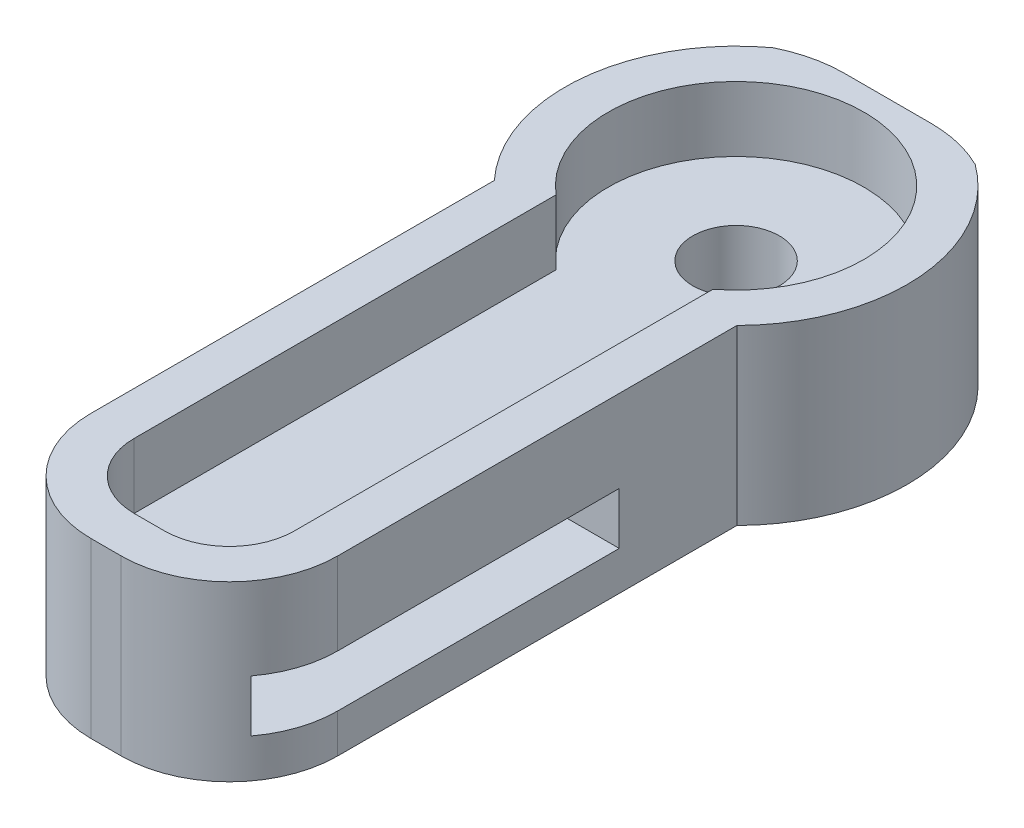
ISO-10303-21;
HEADER;
FILE_DESCRIPTION(('STEP AP214'),'2;1');
FILE_NAME('part.step','',(''),(''),'','','');
FILE_SCHEMA(('AUTOMOTIVE_DESIGN { 1 0 10303 214 1 1 1 1 }'));
ENDSEC;
DATA;
#1=APPLICATION_CONTEXT('core data for automotive mechanical design processes');
#2=APPLICATION_PROTOCOL_DEFINITION('international standard','automotive_design',2000,#1);
#3=PRODUCT_CONTEXT('',#1,'mechanical');
#4=PRODUCT('Part','Part','',(#3));
#5=PRODUCT_RELATED_PRODUCT_CATEGORY('part','',(#4));
#6=PRODUCT_DEFINITION_FORMATION('','',#4);
#7=PRODUCT_DEFINITION_CONTEXT('part definition',#1,'design');
#8=PRODUCT_DEFINITION('design','',#6,#7);
#9=PRODUCT_DEFINITION_SHAPE('','',#8);
#10=(LENGTH_UNIT() NAMED_UNIT(*) SI_UNIT(.MILLI.,.METRE.));
#11=(NAMED_UNIT(*) PLANE_ANGLE_UNIT() SI_UNIT($,.RADIAN.));
#12=(NAMED_UNIT(*) SI_UNIT($,.STERADIAN.) SOLID_ANGLE_UNIT());
#13=UNCERTAINTY_MEASURE_WITH_UNIT(LENGTH_MEASURE(1.E-05),#10,'distance_accuracy_value','');
#14=(GEOMETRIC_REPRESENTATION_CONTEXT(3) GLOBAL_UNCERTAINTY_ASSIGNED_CONTEXT((#13)) GLOBAL_UNIT_ASSIGNED_CONTEXT((#10,
#11,#12)) REPRESENTATION_CONTEXT('',''));
#15=CARTESIAN_POINT('',(0.,0.,0.));
#16=DIRECTION('',(0.,0.,1.));
#17=DIRECTION('',(1.,0.,0.));
#18=AXIS2_PLACEMENT_3D('',#15,#16,#17);
#19=CARTESIAN_POINT('',(4.,4.,9.));
#20=DIRECTION('',(0.,0.,-1.));
#21=DIRECTION('',(-1.,0.,0.));
#22=AXIS2_PLACEMENT_3D('',#19,#20,#21);
#23=PLANE('',#22);
#24=DIRECTION('',(1.,0.,0.));
#25=VECTOR('',#24,1.);
#26=CARTESIAN_POINT('',(4.,0.,9.));
#27=LINE('',#26,#25);
#28=CARTESIAN_POINT('',(-0.397883572957315,0.,9.));
#29=VERTEX_POINT('',#28);
#30=CARTESIAN_POINT('',(0.302116427042685,0.,9.));
#31=VERTEX_POINT('',#30);
#32=EDGE_CURVE('E275',#29,#31,#27,.T.);
#33=ORIENTED_EDGE('',*,*,#32,.T.);
#34=DIRECTION('',(0.,-1.,0.));
#35=VECTOR('',#34,1.);
#36=CARTESIAN_POINT('',(0.302116427042685,34.1246890528022,9.));
#37=LINE('',#36,#35);
#38=CARTESIAN_POINT('',(0.302116427042685,4.,9.));
#39=VERTEX_POINT('',#38);
#40=EDGE_CURVE('E207',#39,#31,#37,.T.);
#41=ORIENTED_EDGE('',*,*,#40,.F.);
#42=DIRECTION('',(1.,0.,0.));
#43=VECTOR('',#42,1.);
#44=CARTESIAN_POINT('',(4.,4.,9.));
#45=LINE('',#44,#43);
#46=CARTESIAN_POINT('',(-0.397883572957315,4.,9.));
#47=VERTEX_POINT('',#46);
#48=EDGE_CURVE('E278',#47,#39,#45,.T.);
#49=ORIENTED_EDGE('',*,*,#48,.F.);
#50=DIRECTION('',(0.,-1.,0.));
#51=VECTOR('',#50,1.);
#52=CARTESIAN_POINT('',(-0.397883572957315,34.1246890528022,9.));
#53=LINE('',#52,#51);
#54=EDGE_CURVE('E461',#47,#29,#53,.T.);
#55=ORIENTED_EDGE('',*,*,#54,.T.);
#56=EDGE_LOOP('',(#33,#41,#49,#55));
#57=FACE_BOUND('',#56,.T.);
#58=ADVANCED_FACE('F36',(#57),#23,.F.);
#59=CARTESIAN_POINT('',(4.,4.,-9.));
#60=DIRECTION('',(0.,0.,1.));
#61=DIRECTION('',(1.,0.,0.));
#62=AXIS2_PLACEMENT_3D('',#59,#60,#61);
#63=PLANE('',#62);
#64=DIRECTION('',(-1.,0.,0.));
#65=VECTOR('',#64,1.);
#66=CARTESIAN_POINT('',(4.,4.,-9.));
#67=LINE('',#66,#65);
#68=CARTESIAN_POINT('',(1.,4.,-9.));
#69=VERTEX_POINT('',#68);
#70=CARTESIAN_POINT('',(-1.,4.,-9.));
#71=VERTEX_POINT('',#70);
#72=EDGE_CURVE('E280',#69,#71,#67,.T.);
#73=ORIENTED_EDGE('',*,*,#72,.F.);
#74=DIRECTION('',(0.,-1.,0.));
#75=VECTOR('',#74,1.);
#76=CARTESIAN_POINT('',(1.,4.,-9.));
#77=LINE('',#76,#75);
#78=CARTESIAN_POINT('',(1.,0.,-9.));
#79=VERTEX_POINT('',#78);
#80=EDGE_CURVE('E196',#69,#79,#77,.T.);
#81=ORIENTED_EDGE('',*,*,#80,.T.);
#82=DIRECTION('',(-1.,0.,0.));
#83=VECTOR('',#82,1.);
#84=CARTESIAN_POINT('',(4.,0.,-9.));
#85=LINE('',#84,#83);
#86=CARTESIAN_POINT('',(-1.,0.,-9.));
#87=VERTEX_POINT('',#86);
#88=EDGE_CURVE('E281',#79,#87,#85,.T.);
#89=ORIENTED_EDGE('',*,*,#88,.T.);
#90=DIRECTION('',(0.,-1.,0.));
#91=VECTOR('',#90,1.);
#92=CARTESIAN_POINT('',(-1.,4.,-9.));
#93=LINE('',#92,#91);
#94=EDGE_CURVE('E191',#87,#71,#93,.F.);
#95=ORIENTED_EDGE('',*,*,#94,.T.);
#96=EDGE_LOOP('',(#73,#81,#89,#95));
#97=FACE_BOUND('',#96,.T.);
#98=ADVANCED_FACE('F351',(#97),#63,.F.);
#99=CARTESIAN_POINT('',(0.,4.,0.));
#100=DIRECTION('',(0.,1.,0.));
#101=DIRECTION('',(0.,0.,1.));
#102=AXIS2_PLACEMENT_3D('',#99,#100,#101);
#103=PLANE('',#102);
#104=CARTESIAN_POINT('',(0.302116427042685,4.,6.5));
#105=DIRECTION('',(0.,1.,0.));
#106=DIRECTION('',(0.,0.,1.));
#107=AXIS2_PLACEMENT_3D('',#104,#105,#106);
#108=CIRCLE('',#107,2.5);
#109=CARTESIAN_POINT('',(2.80211642704269,4.,6.5));
#110=VERTEX_POINT('',#109);
#111=EDGE_CURVE('E51',#110,#39,#108,.F.);
#112=ORIENTED_EDGE('',*,*,#111,.F.);
#113=DIRECTION('',(0.,0.,1.));
#114=VECTOR('',#113,1.);
#115=CARTESIAN_POINT('',(2.80211642704268,4.,0.));
#116=LINE('',#115,#114);
#117=CARTESIAN_POINT('',(2.80211642704268,4.,-2.71600223971039));
#118=VERTEX_POINT('',#117);
#119=EDGE_CURVE('E55',#118,#110,#116,.T.);
#120=ORIENTED_EDGE('',*,*,#119,.F.);
#121=CARTESIAN_POINT('',(0.,4.,-5.5));
#122=DIRECTION('',(0.,1.,0.));
#123=DIRECTION('',(0.,0.,1.));
#124=AXIS2_PLACEMENT_3D('',#121,#122,#123);
#125=CIRCLE('',#124,3.95);
#126=CARTESIAN_POINT('',(2.33227894178525,4.,-8.68794211642951));
#127=VERTEX_POINT('',#126);
#128=EDGE_CURVE('E397',#127,#118,#125,.F.);
#129=ORIENTED_EDGE('',*,*,#128,.F.);
#130=CARTESIAN_POINT('',(1.,4.,-6.));
#131=DIRECTION('',(0.,1.,0.));
#132=DIRECTION('',(0.,0.,1.));
#133=AXIS2_PLACEMENT_3D('',#130,#131,#132);
#134=CIRCLE('',#133,3.);
#135=EDGE_CURVE('E294',#127,#69,#134,.T.);
#136=ORIENTED_EDGE('',*,*,#135,.T.);
#137=ORIENTED_EDGE('',*,*,#72,.T.);
#138=CARTESIAN_POINT('',(-1.,4.,-6.));
#139=DIRECTION('',(0.,1.,0.));
#140=DIRECTION('',(0.,0.,1.));
#141=AXIS2_PLACEMENT_3D('',#138,#139,#140);
#142=CIRCLE('',#141,3.);
#143=CARTESIAN_POINT('',(-2.33227894178524,4.,-8.68794211642952));
#144=VERTEX_POINT('',#143);
#145=EDGE_CURVE('E292',#71,#144,#142,.T.);
#146=ORIENTED_EDGE('',*,*,#145,.T.);
#147=CARTESIAN_POINT('',(-2.89788357295732,4.,-2.81582958857227));
#148=VERTEX_POINT('',#147);
#149=EDGE_CURVE('E206',#148,#144,#125,.F.);
#150=ORIENTED_EDGE('',*,*,#149,.F.);
#151=DIRECTION('',(0.,0.,-1.));
#152=VECTOR('',#151,1.);
#153=CARTESIAN_POINT('',(-2.89788357295732,4.,0.));
#154=LINE('',#153,#152);
#155=CARTESIAN_POINT('',(-2.89788357295732,4.,6.5));
#156=VERTEX_POINT('',#155);
#157=EDGE_CURVE('E418',#156,#148,#154,.T.);
#158=ORIENTED_EDGE('',*,*,#157,.F.);
#159=CARTESIAN_POINT('',(-0.397883572957315,4.,6.5));
#160=DIRECTION('',(0.,1.,0.));
#161=DIRECTION('',(0.,0.,1.));
#162=AXIS2_PLACEMENT_3D('',#159,#160,#161);
#163=CIRCLE('',#162,2.5);
#164=EDGE_CURVE('E410',#47,#156,#163,.F.);
#165=ORIENTED_EDGE('',*,*,#164,.F.);
#166=ORIENTED_EDGE('',*,*,#48,.T.);
#167=EDGE_LOOP('',(#112,#120,#129,#136,#137,#146,#150,#158,#165,#166));
#168=FACE_BOUND('',#167,.T.);
#169=DIRECTION('',(0.,0.,-1.));
#170=VECTOR('',#169,1.);
#171=CARTESIAN_POINT('',(1.80211642704269,4.,8.));
#172=LINE('',#171,#170);
#173=CARTESIAN_POINT('',(1.80211642704269,4.,6.5));
#174=VERTEX_POINT('',#173);
#175=CARTESIAN_POINT('',(1.80211642704268,4.,-3.16443232095858));
#176=VERTEX_POINT('',#175);
#177=EDGE_CURVE('E263',#174,#176,#172,.T.);
#178=ORIENTED_EDGE('',*,*,#177,.F.);
#179=CARTESIAN_POINT('',(0.302116427042685,4.,6.5));
#180=DIRECTION('',(0.,1.,0.));
#181=DIRECTION('',(0.,0.,1.));
#182=AXIS2_PLACEMENT_3D('',#179,#180,#181);
#183=CIRCLE('',#182,1.5);
#184=CARTESIAN_POINT('',(0.302116427042685,4.,8.));
#185=VERTEX_POINT('',#184);
#186=EDGE_CURVE('E213',#174,#185,#183,.F.);
#187=ORIENTED_EDGE('',*,*,#186,.T.);
#188=DIRECTION('',(1.,0.,0.));
#189=VECTOR('',#188,1.);
#190=CARTESIAN_POINT('',(1.80211642704269,4.,8.));
#191=LINE('',#190,#189);
#192=CARTESIAN_POINT('',(-0.397883572957315,4.,8.));
#193=VERTEX_POINT('',#192);
#194=EDGE_CURVE('E253',#193,#185,#191,.T.);
#195=ORIENTED_EDGE('',*,*,#194,.F.);
#196=CARTESIAN_POINT('',(-0.397883572957315,4.,6.5));
#197=DIRECTION('',(0.,1.,0.));
#198=DIRECTION('',(0.,0.,1.));
#199=AXIS2_PLACEMENT_3D('',#196,#197,#198);
#200=CIRCLE('',#199,1.5);
#201=CARTESIAN_POINT('',(-1.89788357295732,4.,6.5));
#202=VERTEX_POINT('',#201);
#203=EDGE_CURVE('E218',#193,#202,#200,.F.);
#204=ORIENTED_EDGE('',*,*,#203,.T.);
#205=DIRECTION('',(0.,0.,1.));
#206=VECTOR('',#205,1.);
#207=CARTESIAN_POINT('',(-1.89788357295732,4.,8.));
#208=LINE('',#207,#206);
#209=CARTESIAN_POINT('',(-1.89788357295732,4.,-3.24156294232078));
#210=VERTEX_POINT('',#209);
#211=EDGE_CURVE('E268',#210,#202,#208,.T.);
#212=ORIENTED_EDGE('',*,*,#211,.F.);
#213=CARTESIAN_POINT('',(0.,4.,-5.5));
#214=DIRECTION('',(0.,1.,0.));
#215=DIRECTION('',(0.,0.,1.));
#216=AXIS2_PLACEMENT_3D('',#213,#214,#215);
#217=CIRCLE('',#216,2.95);
#218=EDGE_CURVE('E265',#176,#210,#217,.T.);
#219=ORIENTED_EDGE('',*,*,#218,.F.);
#220=EDGE_LOOP('',(#178,#187,#195,#204,#212,#219));
#221=FACE_BOUND('',#220,.T.);
#222=ADVANCED_FACE('F313',(#168,#221),#103,.T.);
#223=CARTESIAN_POINT('',(0.,0.,0.));
#224=DIRECTION('',(0.,1.,0.));
#225=DIRECTION('',(0.,0.,1.));
#226=AXIS2_PLACEMENT_3D('',#223,#224,#225);
#227=PLANE('',#226);
#228=CARTESIAN_POINT('',(0.,0.,-5.5));
#229=DIRECTION('',(0.,1.,0.));
#230=DIRECTION('',(0.,0.,1.));
#231=AXIS2_PLACEMENT_3D('',#228,#229,#230);
#232=CIRCLE('',#231,1.);
#233=CARTESIAN_POINT('',(0.,0.,-4.5));
#234=VERTEX_POINT('',#233);
#235=EDGE_CURVE('E246',#234,#234,#232,.T.);
#236=ORIENTED_EDGE('',*,*,#235,.T.);
#237=EDGE_LOOP('',(#236));
#238=FACE_BOUND('',#237,.T.);
#239=DIRECTION('',(0.,0.,1.));
#240=VECTOR('',#239,1.);
#241=CARTESIAN_POINT('',(2.80211642704268,0.,0.));
#242=LINE('',#241,#240);
#243=CARTESIAN_POINT('',(2.80211642704268,0.,-2.71600223971039));
#244=VERTEX_POINT('',#243);
#245=CARTESIAN_POINT('',(2.80211642704269,0.,6.5));
#246=VERTEX_POINT('',#245);
#247=EDGE_CURVE('E425',#244,#246,#242,.T.);
#248=ORIENTED_EDGE('',*,*,#247,.T.);
#249=CARTESIAN_POINT('',(0.302116427042685,0.,6.5));
#250=DIRECTION('',(0.,1.,0.));
#251=DIRECTION('',(0.,0.,1.));
#252=AXIS2_PLACEMENT_3D('',#249,#250,#251);
#253=CIRCLE('',#252,2.5);
#254=EDGE_CURVE('E434',#246,#31,#253,.F.);
#255=ORIENTED_EDGE('',*,*,#254,.T.);
#256=ORIENTED_EDGE('',*,*,#32,.F.);
#257=CARTESIAN_POINT('',(-0.397883572957315,0.,6.5));
#258=DIRECTION('',(0.,1.,0.));
#259=DIRECTION('',(0.,0.,1.));
#260=AXIS2_PLACEMENT_3D('',#257,#258,#259);
#261=CIRCLE('',#260,2.5);
#262=CARTESIAN_POINT('',(-2.89788357295732,0.,6.5));
#263=VERTEX_POINT('',#262);
#264=EDGE_CURVE('E408',#29,#263,#261,.F.);
#265=ORIENTED_EDGE('',*,*,#264,.T.);
#266=DIRECTION('',(0.,0.,-1.));
#267=VECTOR('',#266,1.);
#268=CARTESIAN_POINT('',(-2.89788357295732,0.,0.));
#269=LINE('',#268,#267);
#270=CARTESIAN_POINT('',(-2.89788357295732,0.,-2.81582958857227));
#271=VERTEX_POINT('',#270);
#272=EDGE_CURVE('E202',#263,#271,#269,.T.);
#273=ORIENTED_EDGE('',*,*,#272,.T.);
#274=CARTESIAN_POINT('',(0.,0.,-5.5));
#275=DIRECTION('',(0.,1.,0.));
#276=DIRECTION('',(0.,0.,1.));
#277=AXIS2_PLACEMENT_3D('',#274,#275,#276);
#278=CIRCLE('',#277,3.95);
#279=CARTESIAN_POINT('',(-2.33227894178524,0.,-8.68794211642952));
#280=VERTEX_POINT('',#279);
#281=EDGE_CURVE('E199',#271,#280,#278,.F.);
#282=ORIENTED_EDGE('',*,*,#281,.T.);
#283=CARTESIAN_POINT('',(-1.,0.,-6.));
#284=DIRECTION('',(0.,1.,0.));
#285=DIRECTION('',(0.,0.,1.));
#286=AXIS2_PLACEMENT_3D('',#283,#284,#285);
#287=CIRCLE('',#286,3.);
#288=EDGE_CURVE('E184',#280,#87,#287,.F.);
#289=ORIENTED_EDGE('',*,*,#288,.T.);
#290=ORIENTED_EDGE('',*,*,#88,.F.);
#291=CARTESIAN_POINT('',(1.,0.,-6.));
#292=DIRECTION('',(0.,1.,0.));
#293=DIRECTION('',(0.,0.,1.));
#294=AXIS2_PLACEMENT_3D('',#291,#292,#293);
#295=CIRCLE('',#294,3.);
#296=CARTESIAN_POINT('',(2.33227894178525,0.,-8.68794211642951));
#297=VERTEX_POINT('',#296);
#298=EDGE_CURVE('E195',#79,#297,#295,.F.);
#299=ORIENTED_EDGE('',*,*,#298,.T.);
#300=EDGE_CURVE('E209',#297,#244,#278,.F.);
#301=ORIENTED_EDGE('',*,*,#300,.T.);
#302=EDGE_LOOP('',(#248,#255,#256,#265,#273,#282,#289,#290,#299,#301));
#303=FACE_BOUND('',#302,.T.);
#304=ADVANCED_FACE('F200',(#238,#303),#227,.F.);
#305=CARTESIAN_POINT('',(1.80211642704269,2.5,8.));
#306=DIRECTION('',(1.,0.,0.));
#307=DIRECTION('',(0.,0.,-1.));
#308=AXIS2_PLACEMENT_3D('',#305,#306,#307);
#309=PLANE('',#308);
#310=DIRECTION('',(0.,0.,-1.));
#311=VECTOR('',#310,1.);
#312=CARTESIAN_POINT('',(1.80211642704269,2.5,8.));
#313=LINE('',#312,#311);
#314=CARTESIAN_POINT('',(1.80211642704269,2.5,6.5));
#315=VERTEX_POINT('',#314);
#316=CARTESIAN_POINT('',(1.80211642704268,2.5,-3.16443232095858));
#317=VERTEX_POINT('',#316);
#318=EDGE_CURVE('E250',#315,#317,#313,.T.);
#319=ORIENTED_EDGE('',*,*,#318,.F.);
#320=DIRECTION('',(0.,1.,0.));
#321=VECTOR('',#320,1.);
#322=CARTESIAN_POINT('',(1.80211642704269,4.,6.5));
#323=LINE('',#322,#321);
#324=EDGE_CURVE('E307',#315,#174,#323,.T.);
#325=ORIENTED_EDGE('',*,*,#324,.T.);
#326=ORIENTED_EDGE('',*,*,#177,.T.);
#327=DIRECTION('',(0.,1.,0.));
#328=VECTOR('',#327,1.);
#329=CARTESIAN_POINT('',(1.80211642704268,2.5,-3.16443232095858));
#330=LINE('',#329,#328);
#331=EDGE_CURVE('E262',#317,#176,#330,.T.);
#332=ORIENTED_EDGE('',*,*,#331,.F.);
#333=EDGE_LOOP('',(#319,#325,#326,#332));
#334=FACE_BOUND('',#333,.T.);
#335=ADVANCED_FACE('F335',(#334),#309,.F.);
#336=CARTESIAN_POINT('',(1.80211642704269,2.5,8.));
#337=DIRECTION('',(0.,0.,1.));
#338=DIRECTION('',(1.,0.,0.));
#339=AXIS2_PLACEMENT_3D('',#336,#337,#338);
#340=PLANE('',#339);
#341=DIRECTION('',(1.,0.,0.));
#342=VECTOR('',#341,1.);
#343=CARTESIAN_POINT('',(1.80211642704269,2.5,8.));
#344=LINE('',#343,#342);
#345=CARTESIAN_POINT('',(-0.397883572957315,2.5,8.));
#346=VERTEX_POINT('',#345);
#347=CARTESIAN_POINT('',(0.302116427042685,2.5,8.));
#348=VERTEX_POINT('',#347);
#349=EDGE_CURVE('E259',#346,#348,#344,.T.);
#350=ORIENTED_EDGE('',*,*,#349,.F.);
#351=DIRECTION('',(0.,1.,0.));
#352=VECTOR('',#351,1.);
#353=CARTESIAN_POINT('',(-0.397883572957315,4.,8.));
#354=LINE('',#353,#352);
#355=EDGE_CURVE('E298',#346,#193,#354,.T.);
#356=ORIENTED_EDGE('',*,*,#355,.T.);
#357=ORIENTED_EDGE('',*,*,#194,.T.);
#358=DIRECTION('',(0.,1.,0.));
#359=VECTOR('',#358,1.);
#360=CARTESIAN_POINT('',(0.302116427042685,2.5,8.));
#361=LINE('',#360,#359);
#362=EDGE_CURVE('E296',#185,#348,#361,.F.);
#363=ORIENTED_EDGE('',*,*,#362,.T.);
#364=EDGE_LOOP('',(#350,#356,#357,#363));
#365=FACE_BOUND('',#364,.T.);
#366=ADVANCED_FACE('F328',(#365),#340,.F.);
#367=CARTESIAN_POINT('',(-1.89788357295732,2.5,8.));
#368=DIRECTION('',(-1.,0.,0.));
#369=DIRECTION('',(0.,0.,1.));
#370=AXIS2_PLACEMENT_3D('',#367,#368,#369);
#371=PLANE('',#370);
#372=ORIENTED_EDGE('',*,*,#211,.T.);
#373=DIRECTION('',(0.,1.,0.));
#374=VECTOR('',#373,1.);
#375=CARTESIAN_POINT('',(-1.89788357295732,2.5,6.5));
#376=LINE('',#375,#374);
#377=CARTESIAN_POINT('',(-1.89788357295732,2.5,6.5));
#378=VERTEX_POINT('',#377);
#379=EDGE_CURVE('E301',#202,#378,#376,.F.);
#380=ORIENTED_EDGE('',*,*,#379,.T.);
#381=DIRECTION('',(0.,0.,1.));
#382=VECTOR('',#381,1.);
#383=CARTESIAN_POINT('',(-1.89788357295732,2.5,8.));
#384=LINE('',#383,#382);
#385=CARTESIAN_POINT('',(-1.89788357295732,2.5,-3.24156294232078));
#386=VERTEX_POINT('',#385);
#387=EDGE_CURVE('E256',#386,#378,#384,.T.);
#388=ORIENTED_EDGE('',*,*,#387,.F.);
#389=DIRECTION('',(0.,1.,0.));
#390=VECTOR('',#389,1.);
#391=CARTESIAN_POINT('',(-1.89788357295732,2.5,-3.24156294232078));
#392=LINE('',#391,#390);
#393=EDGE_CURVE('E273',#386,#210,#392,.T.);
#394=ORIENTED_EDGE('',*,*,#393,.T.);
#395=EDGE_LOOP('',(#372,#380,#388,#394));
#396=FACE_BOUND('',#395,.T.);
#397=ADVANCED_FACE('F319',(#396),#371,.F.);
#398=CARTESIAN_POINT('',(0.,2.5,-5.5));
#399=DIRECTION('',(0.,1.,0.));
#400=DIRECTION('',(0.,0.,1.));
#401=AXIS2_PLACEMENT_3D('',#398,#399,#400);
#402=CYLINDRICAL_SURFACE('',#401,2.95);
#403=ORIENTED_EDGE('',*,*,#218,.T.);
#404=ORIENTED_EDGE('',*,*,#393,.F.);
#405=CARTESIAN_POINT('',(0.,2.5,-5.5));
#406=DIRECTION('',(0.,1.,0.));
#407=DIRECTION('',(0.,0.,1.));
#408=AXIS2_PLACEMENT_3D('',#405,#406,#407);
#409=CIRCLE('',#408,2.95);
#410=EDGE_CURVE('E252',#317,#386,#409,.T.);
#411=ORIENTED_EDGE('',*,*,#410,.F.);
#412=ORIENTED_EDGE('',*,*,#331,.T.);
#413=EDGE_LOOP('',(#403,#404,#411,#412));
#414=FACE_BOUND('',#413,.T.);
#415=ADVANCED_FACE('F338',(#414),#402,.F.);
#416=CARTESIAN_POINT('',(0.,2.5,-5.5));
#417=DIRECTION('',(0.,1.,0.));
#418=DIRECTION('',(0.,0.,1.));
#419=AXIS2_PLACEMENT_3D('',#416,#417,#418);
#420=PLANE('',#419);
#421=CARTESIAN_POINT('',(0.,2.5,-5.5));
#422=DIRECTION('',(0.,1.,0.));
#423=DIRECTION('',(0.,0.,1.));
#424=AXIS2_PLACEMENT_3D('',#421,#422,#423);
#425=CIRCLE('',#424,1.);
#426=CARTESIAN_POINT('',(0.,2.5,-4.5));
#427=VERTEX_POINT('',#426);
#428=EDGE_CURVE('E437',#427,#427,#425,.T.);
#429=ORIENTED_EDGE('',*,*,#428,.F.);
#430=EDGE_LOOP('',(#429));
#431=FACE_BOUND('',#430,.T.);
#432=ORIENTED_EDGE('',*,*,#387,.T.);
#433=CARTESIAN_POINT('',(-0.397883572957315,2.5,6.5));
#434=DIRECTION('',(0.,1.,0.));
#435=DIRECTION('',(0.,0.,1.));
#436=AXIS2_PLACEMENT_3D('',#433,#434,#435);
#437=CIRCLE('',#436,1.5);
#438=EDGE_CURVE('E305',#378,#346,#437,.T.);
#439=ORIENTED_EDGE('',*,*,#438,.T.);
#440=ORIENTED_EDGE('',*,*,#349,.T.);
#441=CARTESIAN_POINT('',(0.302116427042685,2.5,6.5));
#442=DIRECTION('',(0.,1.,0.));
#443=DIRECTION('',(0.,0.,1.));
#444=AXIS2_PLACEMENT_3D('',#441,#442,#443);
#445=CIRCLE('',#444,1.5);
#446=EDGE_CURVE('E303',#348,#315,#445,.T.);
#447=ORIENTED_EDGE('',*,*,#446,.T.);
#448=ORIENTED_EDGE('',*,*,#318,.T.);
#449=ORIENTED_EDGE('',*,*,#410,.T.);
#450=EDGE_LOOP('',(#432,#439,#440,#447,#448,#449));
#451=FACE_BOUND('',#450,.T.);
#452=ADVANCED_FACE('F325',(#431,#451),#420,.T.);
#453=CARTESIAN_POINT('',(0.,0.,-5.5));
#454=DIRECTION('',(0.,1.,0.));
#455=DIRECTION('',(0.,0.,1.));
#456=AXIS2_PLACEMENT_3D('',#453,#454,#455);
#457=CYLINDRICAL_SURFACE('',#456,1.);
#458=ORIENTED_EDGE('',*,*,#235,.F.);
#459=EDGE_LOOP('',(#458));
#460=FACE_BOUND('',#459,.T.);
#461=ORIENTED_EDGE('',*,*,#428,.T.);
#462=EDGE_LOOP('',(#461));
#463=FACE_BOUND('',#462,.T.);
#464=ADVANCED_FACE('F345',(#460,#463),#457,.F.);
#465=CARTESIAN_POINT('',(1.,4.,-6.));
#466=DIRECTION('',(0.,-1.,0.));
#467=DIRECTION('',(0.,0.,-1.));
#468=AXIS2_PLACEMENT_3D('',#465,#466,#467);
#469=CYLINDRICAL_SURFACE('',#468,3.);
#470=DIRECTION('',(0.,-1.,0.));
#471=VECTOR('',#470,1.);
#472=CARTESIAN_POINT('',(2.33227894178525,4.,-8.68794211642951));
#473=LINE('',#472,#471);
#474=EDGE_CURVE('E395',#297,#127,#473,.F.);
#475=ORIENTED_EDGE('',*,*,#474,.F.);
#476=ORIENTED_EDGE('',*,*,#298,.F.);
#477=ORIENTED_EDGE('',*,*,#80,.F.);
#478=ORIENTED_EDGE('',*,*,#135,.F.);
#479=EDGE_LOOP('',(#475,#476,#477,#478));
#480=FACE_BOUND('',#479,.T.);
#481=ADVANCED_FACE('F361',(#480),#469,.T.);
#482=CARTESIAN_POINT('',(-1.,4.,-6.));
#483=DIRECTION('',(0.,-1.,0.));
#484=DIRECTION('',(0.,0.,-1.));
#485=AXIS2_PLACEMENT_3D('',#482,#483,#484);
#486=CYLINDRICAL_SURFACE('',#485,3.);
#487=DIRECTION('',(0.,-1.,0.));
#488=VECTOR('',#487,1.);
#489=CARTESIAN_POINT('',(-2.33227894178524,4.,-8.68794211642952));
#490=LINE('',#489,#488);
#491=EDGE_CURVE('E189',#144,#280,#490,.T.);
#492=ORIENTED_EDGE('',*,*,#491,.F.);
#493=ORIENTED_EDGE('',*,*,#145,.F.);
#494=ORIENTED_EDGE('',*,*,#94,.F.);
#495=ORIENTED_EDGE('',*,*,#288,.F.);
#496=EDGE_LOOP('',(#492,#493,#494,#495));
#497=FACE_BOUND('',#496,.T.);
#498=ADVANCED_FACE('F186',(#497),#486,.T.);
#499=CARTESIAN_POINT('',(-0.397883572957315,2.5,6.5));
#500=DIRECTION('',(0.,-1.,0.));
#501=DIRECTION('',(0.,0.,-1.));
#502=AXIS2_PLACEMENT_3D('',#499,#500,#501);
#503=CYLINDRICAL_SURFACE('',#502,1.5);
#504=ORIENTED_EDGE('',*,*,#438,.F.);
#505=ORIENTED_EDGE('',*,*,#379,.F.);
#506=ORIENTED_EDGE('',*,*,#203,.F.);
#507=ORIENTED_EDGE('',*,*,#355,.F.);
#508=EDGE_LOOP('',(#504,#505,#506,#507));
#509=FACE_BOUND('',#508,.T.);
#510=ADVANCED_FACE('F322',(#509),#503,.F.);
#511=CARTESIAN_POINT('',(0.302116427042685,2.5,6.5));
#512=DIRECTION('',(0.,-1.,0.));
#513=DIRECTION('',(0.,0.,-1.));
#514=AXIS2_PLACEMENT_3D('',#511,#512,#513);
#515=CYLINDRICAL_SURFACE('',#514,1.5);
#516=ORIENTED_EDGE('',*,*,#446,.F.);
#517=ORIENTED_EDGE('',*,*,#362,.F.);
#518=ORIENTED_EDGE('',*,*,#186,.F.);
#519=ORIENTED_EDGE('',*,*,#324,.F.);
#520=EDGE_LOOP('',(#516,#517,#518,#519));
#521=FACE_BOUND('',#520,.T.);
#522=ADVANCED_FACE('F38',(#521),#515,.F.);
#523=CARTESIAN_POINT('',(0.,34.1246890528022,-5.5));
#524=DIRECTION('',(0.,-1.,0.));
#525=DIRECTION('',(0.,0.,-1.));
#526=AXIS2_PLACEMENT_3D('',#523,#524,#525);
#527=CYLINDRICAL_SURFACE('',#526,3.95);
#528=DIRECTION('',(0.,-1.,0.));
#529=VECTOR('',#528,1.);
#530=CARTESIAN_POINT('',(-2.89788357295732,34.1246890528022,-2.81582958857227));
#531=LINE('',#530,#529);
#532=EDGE_CURVE('E459',#148,#271,#531,.T.);
#533=ORIENTED_EDGE('',*,*,#532,.F.);
#534=ORIENTED_EDGE('',*,*,#149,.T.);
#535=ORIENTED_EDGE('',*,*,#491,.T.);
#536=ORIENTED_EDGE('',*,*,#281,.F.);
#537=EDGE_LOOP('',(#533,#534,#535,#536));
#538=FACE_BOUND('',#537,.T.);
#539=ADVANCED_FACE('F211',(#538),#527,.T.);
#540=CARTESIAN_POINT('',(-0.397883572957315,34.1246890528022,6.5));
#541=DIRECTION('',(0.,-1.,0.));
#542=DIRECTION('',(0.,0.,-1.));
#543=AXIS2_PLACEMENT_3D('',#540,#541,#542);
#544=CYLINDRICAL_SURFACE('',#543,2.5);
#545=ORIENTED_EDGE('',*,*,#54,.F.);
#546=ORIENTED_EDGE('',*,*,#164,.T.);
#547=DIRECTION('',(0.,-1.,0.));
#548=VECTOR('',#547,1.);
#549=CARTESIAN_POINT('',(-2.89788357295731,34.1246890528022,6.5));
#550=LINE('',#549,#548);
#551=CARTESIAN_POINT('',(-2.89788357295731,2.1,6.5));
#552=VERTEX_POINT('',#551);
#553=EDGE_CURVE('E465',#156,#552,#550,.T.);
#554=ORIENTED_EDGE('',*,*,#553,.T.);
#555=CARTESIAN_POINT('',(-0.397883572957315,2.1,6.5));
#556=DIRECTION('',(0.,1.,0.));
#557=DIRECTION('',(0.,0.,1.));
#558=AXIS2_PLACEMENT_3D('',#555,#556,#557);
#559=CIRCLE('',#558,2.5);
#560=CARTESIAN_POINT('',(-2.39788357295732,2.1,8.));
#561=VERTEX_POINT('',#560);
#562=EDGE_CURVE('E405',#561,#552,#559,.F.);
#563=ORIENTED_EDGE('',*,*,#562,.F.);
#564=DIRECTION('',(0.,-1.,0.));
#565=VECTOR('',#564,1.);
#566=CARTESIAN_POINT('',(-2.39788357295732,34.1246890528022,8.));
#567=LINE('',#566,#565);
#568=CARTESIAN_POINT('',(-2.39788357295732,0.899999999999998,8.));
#569=VERTEX_POINT('',#568);
#570=EDGE_CURVE('E402',#569,#561,#567,.F.);
#571=ORIENTED_EDGE('',*,*,#570,.F.);
#572=CARTESIAN_POINT('',(-0.397883572957315,0.899999999999998,6.5));
#573=DIRECTION('',(0.,-1.,0.));
#574=DIRECTION('',(0.,0.,-1.));
#575=AXIS2_PLACEMENT_3D('',#572,#573,#574);
#576=CIRCLE('',#575,2.5);
#577=CARTESIAN_POINT('',(-2.89788357295731,0.899999999999998,6.5));
#578=VERTEX_POINT('',#577);
#579=EDGE_CURVE('E212',#578,#569,#576,.F.);
#580=ORIENTED_EDGE('',*,*,#579,.F.);
#581=EDGE_CURVE('E462',#578,#263,#550,.T.);
#582=ORIENTED_EDGE('',*,*,#581,.T.);
#583=ORIENTED_EDGE('',*,*,#264,.F.);
#584=EDGE_LOOP('',(#545,#546,#554,#563,#571,#580,#582,#583));
#585=FACE_BOUND('',#584,.T.);
#586=ADVANCED_FACE('F373',(#585),#544,.T.);
#587=CARTESIAN_POINT('',(-2.89788357295732,34.1246890528022,-2.81582958857226));
#588=DIRECTION('',(1.,0.,0.));
#589=DIRECTION('',(0.,0.,-1.));
#590=AXIS2_PLACEMENT_3D('',#587,#588,#589);
#591=PLANE('',#590);
#592=ORIENTED_EDGE('',*,*,#553,.F.);
#593=ORIENTED_EDGE('',*,*,#157,.T.);
#594=ORIENTED_EDGE('',*,*,#532,.T.);
#595=ORIENTED_EDGE('',*,*,#272,.F.);
#596=ORIENTED_EDGE('',*,*,#581,.F.);
#597=DIRECTION('',(0.,0.,1.));
#598=VECTOR('',#597,1.);
#599=CARTESIAN_POINT('',(-2.89788357295732,0.900000000000001,0.));
#600=LINE('',#599,#598);
#601=CARTESIAN_POINT('',(-2.89788357295732,0.900000000000001,0.));
#602=VERTEX_POINT('',#601);
#603=EDGE_CURVE('E216',#602,#578,#600,.T.);
#604=ORIENTED_EDGE('',*,*,#603,.F.);
#605=DIRECTION('',(0.,-1.,0.));
#606=VECTOR('',#605,1.);
#607=CARTESIAN_POINT('',(-2.89788357295732,0.900000000000001,0.));
#608=LINE('',#607,#606);
#609=CARTESIAN_POINT('',(-2.89788357295732,2.1,0.));
#610=VERTEX_POINT('',#609);
#611=EDGE_CURVE('E240',#610,#602,#608,.T.);
#612=ORIENTED_EDGE('',*,*,#611,.F.);
#613=DIRECTION('',(0.,0.,-1.));
#614=VECTOR('',#613,1.);
#615=CARTESIAN_POINT('',(-2.89788357295732,2.1,0.));
#616=LINE('',#615,#614);
#617=EDGE_CURVE('E414',#552,#610,#616,.T.);
#618=ORIENTED_EDGE('',*,*,#617,.F.);
#619=EDGE_LOOP('',(#592,#593,#594,#595,#596,#604,#612,#618));
#620=FACE_BOUND('',#619,.T.);
#621=ADVANCED_FACE('F379',(#620),#591,.F.);
#622=CARTESIAN_POINT('',(0.302116427042685,34.1246890528022,6.5));
#623=DIRECTION('',(0.,-1.,0.));
#624=DIRECTION('',(0.,0.,-1.));
#625=AXIS2_PLACEMENT_3D('',#622,#623,#624);
#626=CYLINDRICAL_SURFACE('',#625,2.5);
#627=DIRECTION('',(0.,-1.,0.));
#628=VECTOR('',#627,1.);
#629=CARTESIAN_POINT('',(2.80211642704269,34.1246890528022,6.5));
#630=LINE('',#629,#628);
#631=CARTESIAN_POINT('',(2.80211642704269,2.1,6.5));
#632=VERTEX_POINT('',#631);
#633=EDGE_CURVE('E451',#110,#632,#630,.T.);
#634=ORIENTED_EDGE('',*,*,#633,.F.);
#635=ORIENTED_EDGE('',*,*,#111,.T.);
#636=ORIENTED_EDGE('',*,*,#40,.T.);
#637=ORIENTED_EDGE('',*,*,#254,.F.);
#638=CARTESIAN_POINT('',(2.80211642704269,0.899999999999998,6.5));
#639=VERTEX_POINT('',#638);
#640=EDGE_CURVE('E452',#639,#246,#630,.T.);
#641=ORIENTED_EDGE('',*,*,#640,.F.);
#642=CARTESIAN_POINT('',(0.302116427042685,0.899999999999998,6.5));
#643=DIRECTION('',(0.,-1.,0.));
#644=DIRECTION('',(0.,0.,-1.));
#645=AXIS2_PLACEMENT_3D('',#642,#643,#644);
#646=CIRCLE('',#645,2.5);
#647=CARTESIAN_POINT('',(2.30211642704269,0.899999999999998,8.));
#648=VERTEX_POINT('',#647);
#649=EDGE_CURVE('E11',#648,#639,#646,.F.);
#650=ORIENTED_EDGE('',*,*,#649,.F.);
#651=DIRECTION('',(0.,-1.,0.));
#652=VECTOR('',#651,1.);
#653=CARTESIAN_POINT('',(2.30211642704269,34.1246890528022,8.));
#654=LINE('',#653,#652);
#655=CARTESIAN_POINT('',(2.30211642704269,2.1,8.));
#656=VERTEX_POINT('',#655);
#657=EDGE_CURVE('E428',#656,#648,#654,.T.);
#658=ORIENTED_EDGE('',*,*,#657,.F.);
#659=CARTESIAN_POINT('',(0.302116427042685,2.1,6.5));
#660=DIRECTION('',(0.,1.,0.));
#661=DIRECTION('',(0.,0.,1.));
#662=AXIS2_PLACEMENT_3D('',#659,#660,#661);
#663=CIRCLE('',#662,2.5);
#664=EDGE_CURVE('E431',#632,#656,#663,.F.);
#665=ORIENTED_EDGE('',*,*,#664,.F.);
#666=EDGE_LOOP('',(#634,#635,#636,#637,#641,#650,#658,#665));
#667=FACE_BOUND('',#666,.T.);
#668=ADVANCED_FACE('F392',(#667),#626,.T.);
#669=CARTESIAN_POINT('',(2.80211642704269,34.1246890528022,6.5));
#670=DIRECTION('',(-1.,0.,0.));
#671=DIRECTION('',(0.,0.,1.));
#672=AXIS2_PLACEMENT_3D('',#669,#670,#671);
#673=PLANE('',#672);
#674=DIRECTION('',(0.,-1.,0.));
#675=VECTOR('',#674,1.);
#676=CARTESIAN_POINT('',(2.80211642704268,34.1246890528022,-2.71600223971039));
#677=LINE('',#676,#675);
#678=EDGE_CURVE('E456',#118,#244,#677,.T.);
#679=ORIENTED_EDGE('',*,*,#678,.F.);
#680=ORIENTED_EDGE('',*,*,#119,.T.);
#681=ORIENTED_EDGE('',*,*,#633,.T.);
#682=DIRECTION('',(0.,0.,1.));
#683=VECTOR('',#682,1.);
#684=CARTESIAN_POINT('',(2.80211642704268,2.1,0.));
#685=LINE('',#684,#683);
#686=CARTESIAN_POINT('',(2.80211642704268,2.1,0.));
#687=VERTEX_POINT('',#686);
#688=EDGE_CURVE('E422',#687,#632,#685,.T.);
#689=ORIENTED_EDGE('',*,*,#688,.F.);
#690=DIRECTION('',(0.,1.,0.));
#691=VECTOR('',#690,1.);
#692=CARTESIAN_POINT('',(2.80211642704268,0.900000000000001,0.));
#693=LINE('',#692,#691);
#694=CARTESIAN_POINT('',(2.80211642704268,0.900000000000001,0.));
#695=VERTEX_POINT('',#694);
#696=EDGE_CURVE('E238',#695,#687,#693,.T.);
#697=ORIENTED_EDGE('',*,*,#696,.F.);
#698=DIRECTION('',(0.,0.,-1.));
#699=VECTOR('',#698,1.);
#700=CARTESIAN_POINT('',(2.80211642704268,0.900000000000001,0.));
#701=LINE('',#700,#699);
#702=EDGE_CURVE('E44',#639,#695,#701,.T.);
#703=ORIENTED_EDGE('',*,*,#702,.F.);
#704=ORIENTED_EDGE('',*,*,#640,.T.);
#705=ORIENTED_EDGE('',*,*,#247,.F.);
#706=EDGE_LOOP('',(#679,#680,#681,#689,#697,#703,#704,#705));
#707=FACE_BOUND('',#706,.T.);
#708=ADVANCED_FACE('F385',(#707),#673,.F.);
#709=ORIENTED_EDGE('',*,*,#474,.T.);
#710=ORIENTED_EDGE('',*,*,#128,.T.);
#711=ORIENTED_EDGE('',*,*,#678,.T.);
#712=ORIENTED_EDGE('',*,*,#300,.F.);
#713=EDGE_LOOP('',(#709,#710,#711,#712));
#714=FACE_BOUND('',#713,.T.);
#715=ADVANCED_FACE('F375',(#714),#527,.T.);
#716=CARTESIAN_POINT('',(-4.,0.900000000000001,0.));
#717=DIRECTION('',(0.,-1.,0.));
#718=DIRECTION('',(0.,0.,-1.));
#719=AXIS2_PLACEMENT_3D('',#716,#717,#718);
#720=PLANE('',#719);
#721=DIRECTION('',(1.,0.,0.));
#722=VECTOR('',#721,1.);
#723=CARTESIAN_POINT('',(-4.,0.9,8.));
#724=LINE('',#723,#722);
#725=EDGE_CURVE('E242',#569,#648,#724,.T.);
#726=ORIENTED_EDGE('',*,*,#725,.T.);
#727=ORIENTED_EDGE('',*,*,#649,.T.);
#728=ORIENTED_EDGE('',*,*,#702,.T.);
#729=DIRECTION('',(1.,0.,0.));
#730=VECTOR('',#729,1.);
#731=CARTESIAN_POINT('',(-4.,0.900000000000001,0.));
#732=LINE('',#731,#730);
#733=EDGE_CURVE('E229',#602,#695,#732,.T.);
#734=ORIENTED_EDGE('',*,*,#733,.F.);
#735=ORIENTED_EDGE('',*,*,#603,.T.);
#736=ORIENTED_EDGE('',*,*,#579,.T.);
#737=EDGE_LOOP('',(#726,#727,#728,#734,#735,#736));
#738=FACE_BOUND('',#737,.T.);
#739=ADVANCED_FACE('F228',(#738),#720,.F.);
#740=CARTESIAN_POINT('',(-4.,0.900000000000001,0.));
#741=DIRECTION('',(0.,0.,-1.));
#742=DIRECTION('',(0.,1.,0.));
#743=AXIS2_PLACEMENT_3D('',#740,#741,#742);
#744=PLANE('',#743);
#745=ORIENTED_EDGE('',*,*,#733,.T.);
#746=ORIENTED_EDGE('',*,*,#696,.T.);
#747=DIRECTION('',(1.,0.,0.));
#748=VECTOR('',#747,1.);
#749=CARTESIAN_POINT('',(-4.,2.1,0.));
#750=LINE('',#749,#748);
#751=EDGE_CURVE('E241',#610,#687,#750,.T.);
#752=ORIENTED_EDGE('',*,*,#751,.F.);
#753=ORIENTED_EDGE('',*,*,#611,.T.);
#754=EDGE_LOOP('',(#745,#746,#752,#753));
#755=FACE_BOUND('',#754,.T.);
#756=ADVANCED_FACE('F236',(#755),#744,.F.);
#757=CARTESIAN_POINT('',(-4.,2.1,0.));
#758=DIRECTION('',(0.,1.,0.));
#759=DIRECTION('',(0.,0.,1.));
#760=AXIS2_PLACEMENT_3D('',#757,#758,#759);
#761=PLANE('',#760);
#762=ORIENTED_EDGE('',*,*,#688,.T.);
#763=ORIENTED_EDGE('',*,*,#664,.T.);
#764=DIRECTION('',(1.,0.,0.));
#765=VECTOR('',#764,1.);
#766=CARTESIAN_POINT('',(-4.,2.1,8.));
#767=LINE('',#766,#765);
#768=EDGE_CURVE('E244',#561,#656,#767,.T.);
#769=ORIENTED_EDGE('',*,*,#768,.F.);
#770=ORIENTED_EDGE('',*,*,#562,.T.);
#771=ORIENTED_EDGE('',*,*,#617,.T.);
#772=ORIENTED_EDGE('',*,*,#751,.T.);
#773=EDGE_LOOP('',(#762,#763,#769,#770,#771,#772));
#774=FACE_BOUND('',#773,.T.);
#775=ADVANCED_FACE('F447',(#774),#761,.F.);
#776=CARTESIAN_POINT('',(-4.,0.9,8.));
#777=DIRECTION('',(0.,0.,1.));
#778=DIRECTION('',(1.,0.,0.));
#779=AXIS2_PLACEMENT_3D('',#776,#777,#778);
#780=PLANE('',#779);
#781=ORIENTED_EDGE('',*,*,#768,.T.);
#782=ORIENTED_EDGE('',*,*,#657,.T.);
#783=ORIENTED_EDGE('',*,*,#725,.F.);
#784=ORIENTED_EDGE('',*,*,#570,.T.);
#785=EDGE_LOOP('',(#781,#782,#783,#784));
#786=FACE_BOUND('',#785,.T.);
#787=ADVANCED_FACE('F444',(#786),#780,.F.);
#788=CLOSED_SHELL('',(#58,#98,#222,#304,#335,#366,#397,#415,#452,#464,#481,#498,#510,#522,#539,
#586,#621,#668,#708,#715,#739,#756,#775,#787));
#789=MANIFOLD_SOLID_BREP('B2',#788);
#790=ADVANCED_BREP_SHAPE_REPRESENTATION('',(#18,#789),#14);
#791=SHAPE_DEFINITION_REPRESENTATION(#9,#790);
ENDSEC;
END-ISO-10303-21;
